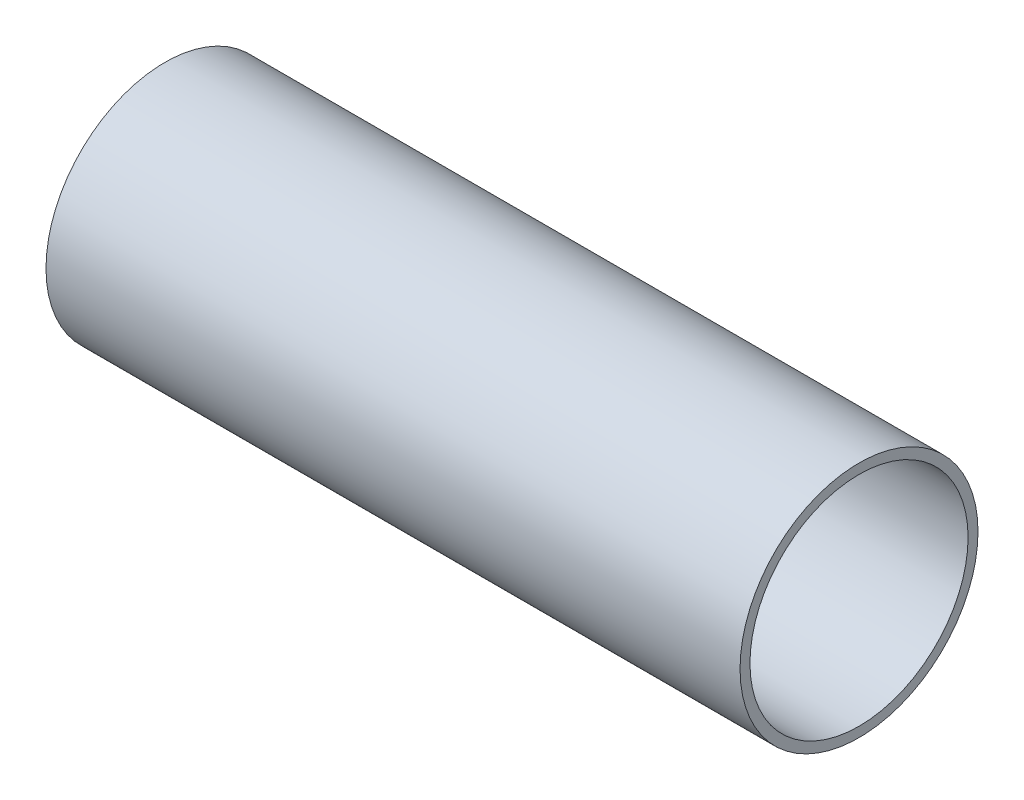
ISO-10303-21;
HEADER;
FILE_DESCRIPTION(('STEP AP214'),'2;1');
FILE_NAME('part.step','',(''),(''),'','','');
FILE_SCHEMA(('AUTOMOTIVE_DESIGN { 1 0 10303 214 1 1 1 1 }'));
ENDSEC;
DATA;
#1=APPLICATION_CONTEXT('core data for automotive mechanical design processes');
#2=APPLICATION_PROTOCOL_DEFINITION('international standard','automotive_design',2000,#1);
#3=PRODUCT_CONTEXT('',#1,'mechanical');
#4=PRODUCT('Part','Part','',(#3));
#5=PRODUCT_RELATED_PRODUCT_CATEGORY('part','',(#4));
#6=PRODUCT_DEFINITION_FORMATION('','',#4);
#7=PRODUCT_DEFINITION_CONTEXT('part definition',#1,'design');
#8=PRODUCT_DEFINITION('design','',#6,#7);
#9=PRODUCT_DEFINITION_SHAPE('','',#8);
#10=(LENGTH_UNIT() NAMED_UNIT(*) SI_UNIT(.MILLI.,.METRE.));
#11=(NAMED_UNIT(*) PLANE_ANGLE_UNIT() SI_UNIT($,.RADIAN.));
#12=(NAMED_UNIT(*) SI_UNIT($,.STERADIAN.) SOLID_ANGLE_UNIT());
#13=UNCERTAINTY_MEASURE_WITH_UNIT(LENGTH_MEASURE(1.E-05),#10,'distance_accuracy_value','');
#14=(GEOMETRIC_REPRESENTATION_CONTEXT(3) GLOBAL_UNCERTAINTY_ASSIGNED_CONTEXT((#13)) GLOBAL_UNIT_ASSIGNED_CONTEXT((#10,
#11,#12)) REPRESENTATION_CONTEXT('',''));
#15=CARTESIAN_POINT('',(0.,0.,0.));
#16=DIRECTION('',(0.,0.,1.));
#17=DIRECTION('',(1.,0.,0.));
#18=AXIS2_PLACEMENT_3D('',#15,#16,#17);
#19=CARTESIAN_POINT('',(350.,0.,0.));
#20=DIRECTION('',(1.,0.,0.));
#21=DIRECTION('',(0.,0.,-1.));
#22=AXIS2_PLACEMENT_3D('',#19,#20,#21);
#23=PLANE('',#22);
#24=CARTESIAN_POINT('',(350.,0.,0.));
#25=DIRECTION('',(1.,0.,0.));
#26=DIRECTION('',(0.,0.,-1.));
#27=AXIS2_PLACEMENT_3D('',#24,#25,#26);
#28=CIRCLE('',#27,60.);
#29=CARTESIAN_POINT('',(350.,0.,-60.));
#30=VERTEX_POINT('',#29);
#31=EDGE_CURVE('E10',#30,#30,#28,.T.);
#32=ORIENTED_EDGE('',*,*,#31,.T.);
#33=EDGE_LOOP('',(#32));
#34=FACE_BOUND('',#33,.T.);
#35=CARTESIAN_POINT('',(350.,0.,0.));
#36=DIRECTION('',(1.,0.,0.));
#37=DIRECTION('',(0.,0.,-1.));
#38=AXIS2_PLACEMENT_3D('',#35,#36,#37);
#39=CIRCLE('',#38,55.);
#40=CARTESIAN_POINT('',(350.,0.,-55.));
#41=VERTEX_POINT('',#40);
#42=EDGE_CURVE('E44',#41,#41,#39,.T.);
#43=ORIENTED_EDGE('',*,*,#42,.F.);
#44=EDGE_LOOP('',(#43));
#45=FACE_BOUND('',#44,.T.);
#46=ADVANCED_FACE('F33',(#34,#45),#23,.T.);
#47=CARTESIAN_POINT('',(0.,0.,0.));
#48=DIRECTION('',(1.,0.,0.));
#49=DIRECTION('',(0.,0.,-1.));
#50=AXIS2_PLACEMENT_3D('',#47,#48,#49);
#51=PLANE('',#50);
#52=CARTESIAN_POINT('',(0.,0.,0.));
#53=DIRECTION('',(1.,0.,0.));
#54=DIRECTION('',(0.,0.,-1.));
#55=AXIS2_PLACEMENT_3D('',#52,#53,#54);
#56=CIRCLE('',#55,60.);
#57=CARTESIAN_POINT('',(0.,0.,-60.));
#58=VERTEX_POINT('',#57);
#59=EDGE_CURVE('E37',#58,#58,#56,.T.);
#60=ORIENTED_EDGE('',*,*,#59,.F.);
#61=EDGE_LOOP('',(#60));
#62=FACE_BOUND('',#61,.T.);
#63=CARTESIAN_POINT('',(0.,0.,0.));
#64=DIRECTION('',(1.,0.,0.));
#65=DIRECTION('',(0.,0.,-1.));
#66=AXIS2_PLACEMENT_3D('',#63,#64,#65);
#67=CIRCLE('',#66,55.);
#68=CARTESIAN_POINT('',(0.,0.,-55.));
#69=VERTEX_POINT('',#68);
#70=EDGE_CURVE('E46',#69,#69,#67,.T.);
#71=ORIENTED_EDGE('',*,*,#70,.T.);
#72=EDGE_LOOP('',(#71));
#73=FACE_BOUND('',#72,.T.);
#74=ADVANCED_FACE('F56',(#62,#73),#51,.F.);
#75=CARTESIAN_POINT('',(350.,0.,0.));
#76=DIRECTION('',(-1.,0.,0.));
#77=DIRECTION('',(0.,0.,1.));
#78=AXIS2_PLACEMENT_3D('',#75,#76,#77);
#79=CYLINDRICAL_SURFACE('',#78,60.);
#80=ORIENTED_EDGE('',*,*,#31,.F.);
#81=EDGE_LOOP('',(#80));
#82=FACE_BOUND('',#81,.T.);
#83=ORIENTED_EDGE('',*,*,#59,.T.);
#84=EDGE_LOOP('',(#83));
#85=FACE_BOUND('',#84,.T.);
#86=ADVANCED_FACE('F35',(#82,#85),#79,.T.);
#87=CARTESIAN_POINT('',(350.,0.,0.));
#88=DIRECTION('',(-1.,0.,0.));
#89=DIRECTION('',(0.,0.,1.));
#90=AXIS2_PLACEMENT_3D('',#87,#88,#89);
#91=CYLINDRICAL_SURFACE('',#90,55.);
#92=ORIENTED_EDGE('',*,*,#42,.T.);
#93=EDGE_LOOP('',(#92));
#94=FACE_BOUND('',#93,.T.);
#95=ORIENTED_EDGE('',*,*,#70,.F.);
#96=EDGE_LOOP('',(#95));
#97=FACE_BOUND('',#96,.T.);
#98=ADVANCED_FACE('F52',(#94,#97),#91,.F.);
#99=CLOSED_SHELL('',(#46,#74,#86,#98));
#100=MANIFOLD_SOLID_BREP('B2',#99);
#101=ADVANCED_BREP_SHAPE_REPRESENTATION('',(#18,#100),#14);
#102=SHAPE_DEFINITION_REPRESENTATION(#9,#101);
ENDSEC;
END-ISO-10303-21;
